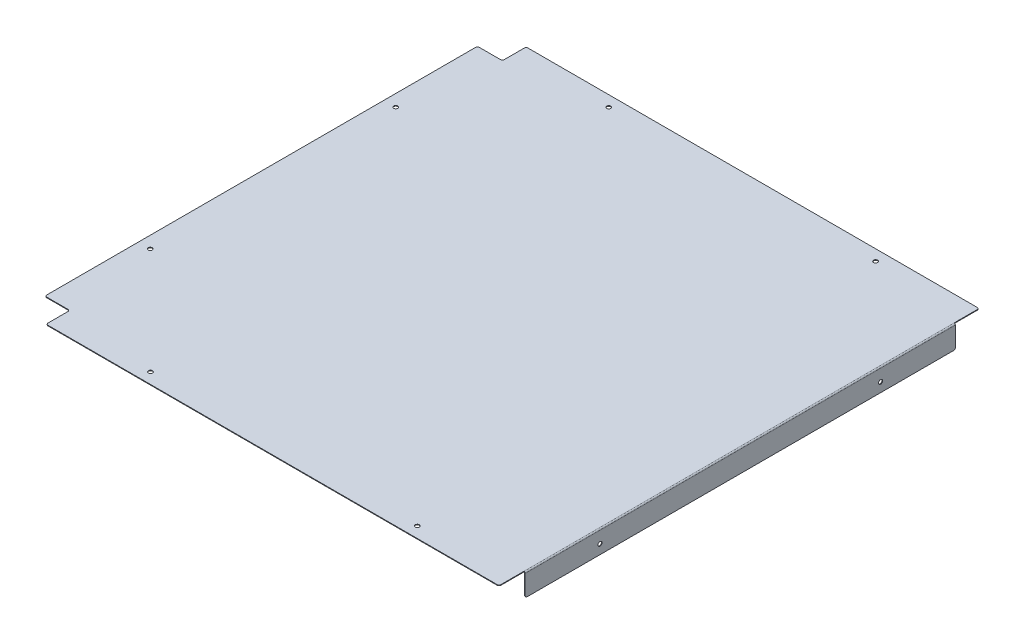
ISO-10303-21;
HEADER;
FILE_DESCRIPTION(('STEP AP214'),'2;1');
FILE_NAME('part.step','',(''),(''),'','','');
FILE_SCHEMA(('AUTOMOTIVE_DESIGN { 1 0 10303 214 1 1 1 1 }'));
ENDSEC;
DATA;
#1=APPLICATION_CONTEXT('core data for automotive mechanical design processes');
#2=APPLICATION_PROTOCOL_DEFINITION('international standard','automotive_design',2000,#1);
#3=PRODUCT_CONTEXT('',#1,'mechanical');
#4=PRODUCT('Part','Part','',(#3));
#5=PRODUCT_RELATED_PRODUCT_CATEGORY('part','',(#4));
#6=PRODUCT_DEFINITION_FORMATION('','',#4);
#7=PRODUCT_DEFINITION_CONTEXT('part definition',#1,'design');
#8=PRODUCT_DEFINITION('design','',#6,#7);
#9=PRODUCT_DEFINITION_SHAPE('','',#8);
#10=(LENGTH_UNIT() NAMED_UNIT(*) SI_UNIT(.MILLI.,.METRE.));
#11=(NAMED_UNIT(*) PLANE_ANGLE_UNIT() SI_UNIT($,.RADIAN.));
#12=(NAMED_UNIT(*) SI_UNIT($,.STERADIAN.) SOLID_ANGLE_UNIT());
#13=UNCERTAINTY_MEASURE_WITH_UNIT(LENGTH_MEASURE(1.E-05),#10,'distance_accuracy_value','');
#14=(GEOMETRIC_REPRESENTATION_CONTEXT(3) GLOBAL_UNCERTAINTY_ASSIGNED_CONTEXT((#13)) GLOBAL_UNIT_ASSIGNED_CONTEXT((#10,
#11,#12)) REPRESENTATION_CONTEXT('',''));
#15=CARTESIAN_POINT('',(0.,0.,0.));
#16=DIRECTION('',(0.,0.,1.));
#17=DIRECTION('',(1.,0.,0.));
#18=AXIS2_PLACEMENT_3D('',#15,#16,#17);
#19=CARTESIAN_POINT('',(362.5,0.,-403.582250064176));
#20=DIRECTION('',(-1.,0.,0.));
#21=DIRECTION('',(0.,0.,1.));
#22=AXIS2_PLACEMENT_3D('',#19,#20,#21);
#23=PLANE('',#22);
#24=DIRECTION('',(0.,0.,1.));
#25=VECTOR('',#24,1.);
#26=CARTESIAN_POINT('',(362.5,0.,0.));
#27=LINE('',#26,#25);
#28=CARTESIAN_POINT('',(362.5,0.,-382.));
#29=VERTEX_POINT('',#28);
#30=CARTESIAN_POINT('',(362.5,0.,-345.));
#31=VERTEX_POINT('',#30);
#32=EDGE_CURVE('E413',#29,#31,#27,.T.);
#33=ORIENTED_EDGE('',*,*,#32,.F.);
#34=DIRECTION('',(0.,-1.,0.));
#35=VECTOR('',#34,1.);
#36=CARTESIAN_POINT('',(362.5,0.99999999999989,-382.));
#37=LINE('',#36,#35);
#38=CARTESIAN_POINT('',(362.5,0.99999999999989,-382.));
#39=VERTEX_POINT('',#38);
#40=EDGE_CURVE('E441',#29,#39,#37,.F.);
#41=ORIENTED_EDGE('',*,*,#40,.T.);
#42=DIRECTION('',(0.,0.,1.));
#43=VECTOR('',#42,1.);
#44=CARTESIAN_POINT('',(362.5,0.99999999999989,-403.582250064176));
#45=LINE('',#44,#43);
#46=CARTESIAN_POINT('',(362.5,1.00000000000011,-345.));
#47=VERTEX_POINT('',#46);
#48=EDGE_CURVE('E308',#39,#47,#45,.T.);
#49=ORIENTED_EDGE('',*,*,#48,.T.);
#50=DIRECTION('',(0.,1.,0.));
#51=VECTOR('',#50,1.);
#52=CARTESIAN_POINT('',(362.5,0.,-345.));
#53=LINE('',#52,#51);
#54=EDGE_CURVE('E301',#31,#47,#53,.T.);
#55=ORIENTED_EDGE('',*,*,#54,.F.);
#56=EDGE_LOOP('',(#33,#41,#49,#55));
#57=FACE_BOUND('',#56,.T.);
#58=ADVANCED_FACE('F64',(#57),#23,.F.);
#59=CARTESIAN_POINT('',(0.,0.99999999999989,-385.));
#60=DIRECTION('',(0.,0.,1.));
#61=DIRECTION('',(1.,0.,0.));
#62=AXIS2_PLACEMENT_3D('',#59,#60,#61);
#63=PLANE('',#62);
#64=DIRECTION('',(1.,0.,0.));
#65=VECTOR('',#64,1.);
#66=CARTESIAN_POINT('',(0.,0.99999999999989,-385.));
#67=LINE('',#66,#65);
#68=CARTESIAN_POINT('',(-361.,0.99999999999989,-385.));
#69=VERTEX_POINT('',#68);
#70=CARTESIAN_POINT('',(359.5,0.99999999999989,-385.));
#71=VERTEX_POINT('',#70);
#72=EDGE_CURVE('E344',#69,#71,#67,.T.);
#73=ORIENTED_EDGE('',*,*,#72,.T.);
#74=DIRECTION('',(0.,1.,0.));
#75=VECTOR('',#74,1.);
#76=CARTESIAN_POINT('',(359.5,0.,-385.));
#77=LINE('',#76,#75);
#78=CARTESIAN_POINT('',(359.5,0.,-385.));
#79=VERTEX_POINT('',#78);
#80=EDGE_CURVE('E467',#71,#79,#77,.F.);
#81=ORIENTED_EDGE('',*,*,#80,.T.);
#82=DIRECTION('',(1.,0.,0.));
#83=VECTOR('',#82,1.);
#84=CARTESIAN_POINT('',(0.,0.,-385.));
#85=LINE('',#84,#83);
#86=CARTESIAN_POINT('',(-361.,0.,-385.));
#87=VERTEX_POINT('',#86);
#88=EDGE_CURVE('E406',#87,#79,#85,.T.);
#89=ORIENTED_EDGE('',*,*,#88,.F.);
#90=DIRECTION('',(0.,1.,0.));
#91=VECTOR('',#90,1.);
#92=CARTESIAN_POINT('',(-361.,0.99999999999989,-385.));
#93=LINE('',#92,#91);
#94=EDGE_CURVE('E463',#87,#69,#93,.T.);
#95=ORIENTED_EDGE('',*,*,#94,.T.);
#96=EDGE_LOOP('',(#73,#81,#89,#95));
#97=FACE_BOUND('',#96,.T.);
#98=ADVANCED_FACE('F586',(#97),#63,.F.);
#99=CARTESIAN_POINT('',(-364.,0.99999999999989,5.3008102957558E-13));
#100=DIRECTION('',(-1.,0.,0.));
#101=DIRECTION('',(0.,0.,1.));
#102=AXIS2_PLACEMENT_3D('',#99,#100,#101);
#103=PLANE('',#102);
#104=DIRECTION('',(0.,0.,1.));
#105=VECTOR('',#104,1.);
#106=CARTESIAN_POINT('',(-364.,0.99999999999989,5.3008102957558E-13));
#107=LINE('',#106,#105);
#108=CARTESIAN_POINT('',(-364.,0.99999999999989,-382.));
#109=VERTEX_POINT('',#108);
#110=CARTESIAN_POINT('',(-364.,0.99999999999989,-349.881188118812));
#111=VERTEX_POINT('',#110);
#112=EDGE_CURVE('E348',#109,#111,#107,.T.);
#113=ORIENTED_EDGE('',*,*,#112,.F.);
#114=DIRECTION('',(0.,-1.,0.));
#115=VECTOR('',#114,1.);
#116=CARTESIAN_POINT('',(-364.,0.99999999999989,-382.));
#117=LINE('',#116,#115);
#118=CARTESIAN_POINT('',(-364.,0.,-382.));
#119=VERTEX_POINT('',#118);
#120=EDGE_CURVE('E88',#109,#119,#117,.T.);
#121=ORIENTED_EDGE('',*,*,#120,.T.);
#122=DIRECTION('',(0.,0.,1.));
#123=VECTOR('',#122,1.);
#124=CARTESIAN_POINT('',(-364.,0.,0.));
#125=LINE('',#124,#123);
#126=CARTESIAN_POINT('',(-364.,0.,-349.881188118812));
#127=VERTEX_POINT('',#126);
#128=EDGE_CURVE('E403',#119,#127,#125,.T.);
#129=ORIENTED_EDGE('',*,*,#128,.T.);
#130=DIRECTION('',(0.,-1.,0.));
#131=VECTOR('',#130,1.);
#132=CARTESIAN_POINT('',(-364.,0.99999999999989,-349.881188118812));
#133=LINE('',#132,#131);
#134=EDGE_CURVE('E487',#127,#111,#133,.F.);
#135=ORIENTED_EDGE('',*,*,#134,.T.);
#136=EDGE_LOOP('',(#113,#121,#129,#135));
#137=FACE_BOUND('',#136,.T.);
#138=ADVANCED_FACE('F578',(#137),#103,.T.);
#139=CARTESIAN_POINT('',(0.,0.99999999999989,-346.881188118812));
#140=DIRECTION('',(0.,0.,1.));
#141=DIRECTION('',(1.,0.,0.));
#142=AXIS2_PLACEMENT_3D('',#139,#140,#141);
#143=PLANE('',#142);
#144=DIRECTION('',(1.,0.,0.));
#145=VECTOR('',#144,1.);
#146=CARTESIAN_POINT('',(0.,0.99999999999989,-346.881188118812));
#147=LINE('',#146,#145);
#148=CARTESIAN_POINT('',(-401.,0.99999999999989,-346.881188118812));
#149=VERTEX_POINT('',#148);
#150=CARTESIAN_POINT('',(-367.,0.99999999999989,-346.881188118812));
#151=VERTEX_POINT('',#150);
#152=EDGE_CURVE('E352',#149,#151,#147,.T.);
#153=ORIENTED_EDGE('',*,*,#152,.T.);
#154=DIRECTION('',(0.,1.,0.));
#155=VECTOR('',#154,1.);
#156=CARTESIAN_POINT('',(-367.,0.,-346.881188118812));
#157=LINE('',#156,#155);
#158=CARTESIAN_POINT('',(-367.,0.,-346.881188118812));
#159=VERTEX_POINT('',#158);
#160=EDGE_CURVE('E497',#151,#159,#157,.F.);
#161=ORIENTED_EDGE('',*,*,#160,.T.);
#162=DIRECTION('',(1.,0.,0.));
#163=VECTOR('',#162,1.);
#164=CARTESIAN_POINT('',(0.,0.,-346.881188118812));
#165=LINE('',#164,#163);
#166=CARTESIAN_POINT('',(-401.,0.,-346.881188118812));
#167=VERTEX_POINT('',#166);
#168=EDGE_CURVE('E400',#167,#159,#165,.T.);
#169=ORIENTED_EDGE('',*,*,#168,.F.);
#170=DIRECTION('',(0.,-1.,0.));
#171=VECTOR('',#170,1.);
#172=CARTESIAN_POINT('',(-401.,0.99999999999989,-346.881188118812));
#173=LINE('',#172,#171);
#174=EDGE_CURVE('E493',#167,#149,#173,.F.);
#175=ORIENTED_EDGE('',*,*,#174,.T.);
#176=EDGE_LOOP('',(#153,#161,#169,#175));
#177=FACE_BOUND('',#176,.T.);
#178=ADVANCED_FACE('F572',(#177),#143,.F.);
#179=CARTESIAN_POINT('',(-404.,0.99999999999989,0.));
#180=DIRECTION('',(1.,0.,0.));
#181=DIRECTION('',(0.,0.,-1.));
#182=AXIS2_PLACEMENT_3D('',#179,#180,#181);
#183=PLANE('',#182);
#184=DIRECTION('',(0.,0.,-1.));
#185=VECTOR('',#184,1.);
#186=CARTESIAN_POINT('',(-404.,0.99999999999989,0.));
#187=LINE('',#186,#185);
#188=CARTESIAN_POINT('',(-404.,0.99999999999989,343.881188118812));
#189=VERTEX_POINT('',#188);
#190=CARTESIAN_POINT('',(-404.,0.99999999999989,-343.881188118812));
#191=VERTEX_POINT('',#190);
#192=EDGE_CURVE('E356',#189,#191,#187,.T.);
#193=ORIENTED_EDGE('',*,*,#192,.T.);
#194=DIRECTION('',(0.,-1.,0.));
#195=VECTOR('',#194,1.);
#196=CARTESIAN_POINT('',(-404.,0.99999999999989,-343.881188118812));
#197=LINE('',#196,#195);
#198=CARTESIAN_POINT('',(-404.,0.,-343.881188118812));
#199=VERTEX_POINT('',#198);
#200=EDGE_CURVE('E504',#191,#199,#197,.T.);
#201=ORIENTED_EDGE('',*,*,#200,.T.);
#202=DIRECTION('',(0.,0.,1.));
#203=VECTOR('',#202,1.);
#204=CARTESIAN_POINT('',(-404.,0.,0.));
#205=LINE('',#204,#203);
#206=CARTESIAN_POINT('',(-404.,0.,343.881188118812));
#207=VERTEX_POINT('',#206);
#208=EDGE_CURVE('E396',#207,#199,#205,.F.);
#209=ORIENTED_EDGE('',*,*,#208,.F.);
#210=DIRECTION('',(0.,1.,0.));
#211=VECTOR('',#210,1.);
#212=CARTESIAN_POINT('',(-404.,0.99999999999989,343.881188118812));
#213=LINE('',#212,#211);
#214=EDGE_CURVE('E500',#207,#189,#213,.T.);
#215=ORIENTED_EDGE('',*,*,#214,.T.);
#216=EDGE_LOOP('',(#193,#201,#209,#215));
#217=FACE_BOUND('',#216,.T.);
#218=ADVANCED_FACE('F564',(#217),#183,.F.);
#219=CARTESIAN_POINT('',(0.,0.99999999999989,346.881188118812));
#220=DIRECTION('',(0.,0.,1.));
#221=DIRECTION('',(1.,0.,0.));
#222=AXIS2_PLACEMENT_3D('',#219,#220,#221);
#223=PLANE('',#222);
#224=DIRECTION('',(1.,0.,0.));
#225=VECTOR('',#224,1.);
#226=CARTESIAN_POINT('',(0.,0.99999999999989,346.881188118812));
#227=LINE('',#226,#225);
#228=CARTESIAN_POINT('',(-401.,0.99999999999989,346.881188118812));
#229=VERTEX_POINT('',#228);
#230=CARTESIAN_POINT('',(-367.,0.99999999999989,346.881188118812));
#231=VERTEX_POINT('',#230);
#232=EDGE_CURVE('E360',#229,#231,#227,.T.);
#233=ORIENTED_EDGE('',*,*,#232,.F.);
#234=DIRECTION('',(0.,-1.,0.));
#235=VECTOR('',#234,1.);
#236=CARTESIAN_POINT('',(-401.,0.99999999999989,346.881188118812));
#237=LINE('',#236,#235);
#238=CARTESIAN_POINT('',(-401.,0.,346.881188118812));
#239=VERTEX_POINT('',#238);
#240=EDGE_CURVE('E511',#229,#239,#237,.T.);
#241=ORIENTED_EDGE('',*,*,#240,.T.);
#242=DIRECTION('',(1.,0.,0.));
#243=VECTOR('',#242,1.);
#244=CARTESIAN_POINT('',(0.,0.,346.881188118812));
#245=LINE('',#244,#243);
#246=CARTESIAN_POINT('',(-367.,0.,346.881188118812));
#247=VERTEX_POINT('',#246);
#248=EDGE_CURVE('E317',#239,#247,#245,.T.);
#249=ORIENTED_EDGE('',*,*,#248,.T.);
#250=DIRECTION('',(0.,-1.,0.));
#251=VECTOR('',#250,1.);
#252=CARTESIAN_POINT('',(-367.,0.99999999999989,346.881188118812));
#253=LINE('',#252,#251);
#254=EDGE_CURVE('E507',#247,#231,#253,.F.);
#255=ORIENTED_EDGE('',*,*,#254,.T.);
#256=EDGE_LOOP('',(#233,#241,#249,#255));
#257=FACE_BOUND('',#256,.T.);
#258=ADVANCED_FACE('F556',(#257),#223,.T.);
#259=CARTESIAN_POINT('',(-364.,0.99999999999989,-5.3008102957558E-13));
#260=DIRECTION('',(1.,0.,0.));
#261=DIRECTION('',(0.,0.,-1.));
#262=AXIS2_PLACEMENT_3D('',#259,#260,#261);
#263=PLANE('',#262);
#264=DIRECTION('',(0.,0.,-1.));
#265=VECTOR('',#264,1.);
#266=CARTESIAN_POINT('',(-364.,0.99999999999989,-5.3008102957558E-13));
#267=LINE('',#266,#265);
#268=CARTESIAN_POINT('',(-364.,0.99999999999989,382.));
#269=VERTEX_POINT('',#268);
#270=CARTESIAN_POINT('',(-364.,0.99999999999989,349.881188118812));
#271=VERTEX_POINT('',#270);
#272=EDGE_CURVE('E336',#269,#271,#267,.T.);
#273=ORIENTED_EDGE('',*,*,#272,.T.);
#274=DIRECTION('',(0.,1.,0.));
#275=VECTOR('',#274,1.);
#276=CARTESIAN_POINT('',(-364.,0.,349.881188118812));
#277=LINE('',#276,#275);
#278=CARTESIAN_POINT('',(-364.,0.,349.881188118812));
#279=VERTEX_POINT('',#278);
#280=EDGE_CURVE('E518',#271,#279,#277,.F.);
#281=ORIENTED_EDGE('',*,*,#280,.T.);
#282=DIRECTION('',(0.,0.,1.));
#283=VECTOR('',#282,1.);
#284=CARTESIAN_POINT('',(-364.,0.,0.));
#285=LINE('',#284,#283);
#286=CARTESIAN_POINT('',(-364.,0.,382.));
#287=VERTEX_POINT('',#286);
#288=EDGE_CURVE('E388',#287,#279,#285,.F.);
#289=ORIENTED_EDGE('',*,*,#288,.F.);
#290=DIRECTION('',(0.,1.,0.));
#291=VECTOR('',#290,1.);
#292=CARTESIAN_POINT('',(-364.,0.99999999999989,382.));
#293=LINE('',#292,#291);
#294=EDGE_CURVE('E514',#287,#269,#293,.T.);
#295=ORIENTED_EDGE('',*,*,#294,.T.);
#296=EDGE_LOOP('',(#273,#281,#289,#295));
#297=FACE_BOUND('',#296,.T.);
#298=ADVANCED_FACE('F547',(#297),#263,.F.);
#299=CARTESIAN_POINT('',(-214.,1.00000000000011,367.5));
#300=DIRECTION('',(0.,1.,0.));
#301=DIRECTION('',(0.,0.,1.));
#302=AXIS2_PLACEMENT_3D('',#299,#300,#301);
#303=CYLINDRICAL_SURFACE('',#302,3.3);
#304=CARTESIAN_POINT('',(-214.,1.00000000000011,367.5));
#305=DIRECTION('',(0.,1.,0.));
#306=DIRECTION('',(0.,0.,1.));
#307=AXIS2_PLACEMENT_3D('',#304,#305,#306);
#308=CIRCLE('',#307,3.3);
#309=CARTESIAN_POINT('',(-214.,1.00000000000011,370.8));
#310=VERTEX_POINT('',#309);
#311=EDGE_CURVE('E312',#310,#310,#308,.T.);
#312=ORIENTED_EDGE('',*,*,#311,.T.);
#313=EDGE_LOOP('',(#312));
#314=FACE_BOUND('',#313,.T.);
#315=CARTESIAN_POINT('',(-214.,0.,367.5));
#316=DIRECTION('',(0.,1.,0.));
#317=DIRECTION('',(0.,0.,1.));
#318=AXIS2_PLACEMENT_3D('',#315,#316,#317);
#319=CIRCLE('',#318,3.3);
#320=CARTESIAN_POINT('',(-214.,0.,370.8));
#321=VERTEX_POINT('',#320);
#322=EDGE_CURVE('E311',#321,#321,#319,.T.);
#323=ORIENTED_EDGE('',*,*,#322,.F.);
#324=EDGE_LOOP('',(#323));
#325=FACE_BOUND('',#324,.T.);
#326=ADVANCED_FACE('F674',(#314,#325),#303,.F.);
#327=CARTESIAN_POINT('',(-385.,1.00000000000011,196.881188118812));
#328=DIRECTION('',(0.,1.,0.));
#329=DIRECTION('',(0.,0.,1.));
#330=AXIS2_PLACEMENT_3D('',#327,#328,#329);
#331=CYLINDRICAL_SURFACE('',#330,3.29999999999997);
#332=CARTESIAN_POINT('',(-385.,1.00000000000011,196.881188118812));
#333=DIRECTION('',(0.,1.,0.));
#334=DIRECTION('',(0.,0.,1.));
#335=AXIS2_PLACEMENT_3D('',#332,#333,#334);
#336=CIRCLE('',#335,3.29999999999997);
#337=CARTESIAN_POINT('',(-385.,1.00000000000011,200.181188118812));
#338=VERTEX_POINT('',#337);
#339=EDGE_CURVE('E316',#338,#338,#336,.T.);
#340=ORIENTED_EDGE('',*,*,#339,.T.);
#341=EDGE_LOOP('',(#340));
#342=FACE_BOUND('',#341,.T.);
#343=CARTESIAN_POINT('',(-385.,0.,196.881188118812));
#344=DIRECTION('',(0.,1.,0.));
#345=DIRECTION('',(0.,0.,1.));
#346=AXIS2_PLACEMENT_3D('',#343,#344,#345);
#347=CIRCLE('',#346,3.29999999999997);
#348=CARTESIAN_POINT('',(-385.,0.,200.181188118812));
#349=VERTEX_POINT('',#348);
#350=EDGE_CURVE('E368',#349,#349,#347,.T.);
#351=ORIENTED_EDGE('',*,*,#350,.F.);
#352=EDGE_LOOP('',(#351));
#353=FACE_BOUND('',#352,.T.);
#354=ADVANCED_FACE('F677',(#342,#353),#331,.F.);
#355=CARTESIAN_POINT('',(-385.,1.00000000000011,-196.881188118812));
#356=DIRECTION('',(0.,1.,0.));
#357=DIRECTION('',(0.,0.,1.));
#358=AXIS2_PLACEMENT_3D('',#355,#356,#357);
#359=CYLINDRICAL_SURFACE('',#358,3.29999999999997);
#360=CARTESIAN_POINT('',(-385.,1.00000000000011,-196.881188118812));
#361=DIRECTION('',(0.,1.,0.));
#362=DIRECTION('',(0.,0.,1.));
#363=AXIS2_PLACEMENT_3D('',#360,#361,#362);
#364=CIRCLE('',#363,3.29999999999997);
#365=CARTESIAN_POINT('',(-385.,1.00000000000011,-193.581188118812));
#366=VERTEX_POINT('',#365);
#367=EDGE_CURVE('E321',#366,#366,#364,.T.);
#368=ORIENTED_EDGE('',*,*,#367,.T.);
#369=EDGE_LOOP('',(#368));
#370=FACE_BOUND('',#369,.T.);
#371=CARTESIAN_POINT('',(-385.,0.,-196.881188118812));
#372=DIRECTION('',(0.,1.,0.));
#373=DIRECTION('',(0.,0.,1.));
#374=AXIS2_PLACEMENT_3D('',#371,#372,#373);
#375=CIRCLE('',#374,3.29999999999997);
#376=CARTESIAN_POINT('',(-385.,0.,-193.581188118812));
#377=VERTEX_POINT('',#376);
#378=EDGE_CURVE('E372',#377,#377,#375,.T.);
#379=ORIENTED_EDGE('',*,*,#378,.F.);
#380=EDGE_LOOP('',(#379));
#381=FACE_BOUND('',#380,.T.);
#382=ADVANCED_FACE('F681',(#370,#381),#359,.F.);
#383=CARTESIAN_POINT('',(-214.,1.00000000000011,-367.5));
#384=DIRECTION('',(0.,1.,0.));
#385=DIRECTION('',(0.,0.,1.));
#386=AXIS2_PLACEMENT_3D('',#383,#384,#385);
#387=CYLINDRICAL_SURFACE('',#386,3.3);
#388=CARTESIAN_POINT('',(-214.,1.00000000000011,-367.5));
#389=DIRECTION('',(0.,1.,0.));
#390=DIRECTION('',(0.,0.,1.));
#391=AXIS2_PLACEMENT_3D('',#388,#389,#390);
#392=CIRCLE('',#391,3.3);
#393=CARTESIAN_POINT('',(-214.,1.00000000000011,-364.2));
#394=VERTEX_POINT('',#393);
#395=EDGE_CURVE('E324',#394,#394,#392,.T.);
#396=ORIENTED_EDGE('',*,*,#395,.T.);
#397=EDGE_LOOP('',(#396));
#398=FACE_BOUND('',#397,.T.);
#399=CARTESIAN_POINT('',(-214.,0.,-367.5));
#400=DIRECTION('',(0.,1.,0.));
#401=DIRECTION('',(0.,0.,1.));
#402=AXIS2_PLACEMENT_3D('',#399,#400,#401);
#403=CIRCLE('',#402,3.3);
#404=CARTESIAN_POINT('',(-214.,0.,-364.2));
#405=VERTEX_POINT('',#404);
#406=EDGE_CURVE('E376',#405,#405,#403,.T.);
#407=ORIENTED_EDGE('',*,*,#406,.F.);
#408=EDGE_LOOP('',(#407));
#409=FACE_BOUND('',#408,.T.);
#410=ADVANCED_FACE('F685',(#398,#409),#387,.F.);
#411=CARTESIAN_POINT('',(214.,1.00000000000011,-367.5));
#412=DIRECTION('',(0.,1.,0.));
#413=DIRECTION('',(0.,0.,1.));
#414=AXIS2_PLACEMENT_3D('',#411,#412,#413);
#415=CYLINDRICAL_SURFACE('',#414,3.3);
#416=CARTESIAN_POINT('',(214.,1.00000000000011,-367.5));
#417=DIRECTION('',(0.,1.,0.));
#418=DIRECTION('',(0.,0.,1.));
#419=AXIS2_PLACEMENT_3D('',#416,#417,#418);
#420=CIRCLE('',#419,3.3);
#421=CARTESIAN_POINT('',(214.,1.00000000000011,-364.2));
#422=VERTEX_POINT('',#421);
#423=EDGE_CURVE('E328',#422,#422,#420,.T.);
#424=ORIENTED_EDGE('',*,*,#423,.T.);
#425=EDGE_LOOP('',(#424));
#426=FACE_BOUND('',#425,.T.);
#427=CARTESIAN_POINT('',(214.,0.,-367.5));
#428=DIRECTION('',(0.,1.,0.));
#429=DIRECTION('',(0.,0.,1.));
#430=AXIS2_PLACEMENT_3D('',#427,#428,#429);
#431=CIRCLE('',#430,3.3);
#432=CARTESIAN_POINT('',(214.,0.,-364.2));
#433=VERTEX_POINT('',#432);
#434=EDGE_CURVE('E380',#433,#433,#431,.T.);
#435=ORIENTED_EDGE('',*,*,#434,.F.);
#436=EDGE_LOOP('',(#435));
#437=FACE_BOUND('',#436,.T.);
#438=ADVANCED_FACE('F689',(#426,#437),#415,.F.);
#439=CARTESIAN_POINT('',(214.,1.00000000000011,367.5));
#440=DIRECTION('',(0.,1.,0.));
#441=DIRECTION('',(0.,0.,1.));
#442=AXIS2_PLACEMENT_3D('',#439,#440,#441);
#443=CYLINDRICAL_SURFACE('',#442,3.3);
#444=CARTESIAN_POINT('',(214.,1.00000000000011,367.5));
#445=DIRECTION('',(0.,1.,0.));
#446=DIRECTION('',(0.,0.,1.));
#447=AXIS2_PLACEMENT_3D('',#444,#445,#446);
#448=CIRCLE('',#447,3.3);
#449=CARTESIAN_POINT('',(214.,1.00000000000011,370.8));
#450=VERTEX_POINT('',#449);
#451=EDGE_CURVE('E332',#450,#450,#448,.T.);
#452=ORIENTED_EDGE('',*,*,#451,.T.);
#453=EDGE_LOOP('',(#452));
#454=FACE_BOUND('',#453,.T.);
#455=CARTESIAN_POINT('',(214.,0.,367.5));
#456=DIRECTION('',(0.,1.,0.));
#457=DIRECTION('',(0.,0.,1.));
#458=AXIS2_PLACEMENT_3D('',#455,#456,#457);
#459=CIRCLE('',#458,3.3);
#460=CARTESIAN_POINT('',(214.,0.,370.8));
#461=VERTEX_POINT('',#460);
#462=EDGE_CURVE('E384',#461,#461,#459,.T.);
#463=ORIENTED_EDGE('',*,*,#462,.F.);
#464=EDGE_LOOP('',(#463));
#465=FACE_BOUND('',#464,.T.);
#466=ADVANCED_FACE('F693',(#454,#465),#443,.F.);
#467=CARTESIAN_POINT('',(0.,0.99999999999989,385.));
#468=DIRECTION('',(0.,0.,1.));
#469=DIRECTION('',(1.,0.,0.));
#470=AXIS2_PLACEMENT_3D('',#467,#468,#469);
#471=PLANE('',#470);
#472=DIRECTION('',(1.,0.,0.));
#473=VECTOR('',#472,1.);
#474=CARTESIAN_POINT('',(0.,0.99999999999989,385.));
#475=LINE('',#474,#473);
#476=CARTESIAN_POINT('',(-361.,0.99999999999989,385.));
#477=VERTEX_POINT('',#476);
#478=CARTESIAN_POINT('',(359.5,0.99999999999989,385.));
#479=VERTEX_POINT('',#478);
#480=EDGE_CURVE('E340',#477,#479,#475,.T.);
#481=ORIENTED_EDGE('',*,*,#480,.F.);
#482=DIRECTION('',(0.,-1.,0.));
#483=VECTOR('',#482,1.);
#484=CARTESIAN_POINT('',(-361.,0.99999999999989,385.));
#485=LINE('',#484,#483);
#486=CARTESIAN_POINT('',(-361.,0.,385.));
#487=VERTEX_POINT('',#486);
#488=EDGE_CURVE('E524',#477,#487,#485,.T.);
#489=ORIENTED_EDGE('',*,*,#488,.T.);
#490=DIRECTION('',(1.,0.,0.));
#491=VECTOR('',#490,1.);
#492=CARTESIAN_POINT('',(0.,0.,385.));
#493=LINE('',#492,#491);
#494=CARTESIAN_POINT('',(359.5,0.,385.));
#495=VERTEX_POINT('',#494);
#496=EDGE_CURVE('E392',#487,#495,#493,.T.);
#497=ORIENTED_EDGE('',*,*,#496,.T.);
#498=DIRECTION('',(0.,-1.,0.));
#499=VECTOR('',#498,1.);
#500=CARTESIAN_POINT('',(359.5,0.99999999999989,385.));
#501=LINE('',#500,#499);
#502=EDGE_CURVE('E521',#495,#479,#501,.F.);
#503=ORIENTED_EDGE('',*,*,#502,.T.);
#504=EDGE_LOOP('',(#481,#489,#497,#503));
#505=FACE_BOUND('',#504,.T.);
#506=ADVANCED_FACE('F671',(#505),#471,.T.);
#507=CARTESIAN_POINT('',(0.,0.99999999999989,0.));
#508=DIRECTION('',(0.,1.,0.));
#509=DIRECTION('',(0.,0.,1.));
#510=AXIS2_PLACEMENT_3D('',#507,#508,#509);
#511=PLANE('',#510);
#512=ORIENTED_EDGE('',*,*,#48,.F.);
#513=CARTESIAN_POINT('',(359.5,0.99999999999989,-382.));
#514=DIRECTION('',(0.,1.,0.));
#515=DIRECTION('',(0.,0.,1.));
#516=AXIS2_PLACEMENT_3D('',#513,#514,#515);
#517=CIRCLE('',#516,3.);
#518=EDGE_CURVE('E460',#39,#71,#517,.T.);
#519=ORIENTED_EDGE('',*,*,#518,.T.);
#520=ORIENTED_EDGE('',*,*,#72,.F.);
#521=CARTESIAN_POINT('',(-361.,0.99999999999989,-382.));
#522=DIRECTION('',(0.,1.,0.));
#523=DIRECTION('',(0.,0.,1.));
#524=AXIS2_PLACEMENT_3D('',#521,#522,#523);
#525=CIRCLE('',#524,3.);
#526=EDGE_CURVE('E457',#69,#109,#525,.T.);
#527=ORIENTED_EDGE('',*,*,#526,.T.);
#528=ORIENTED_EDGE('',*,*,#112,.T.);
#529=CARTESIAN_POINT('',(-367.,0.99999999999989,-349.881188118812));
#530=DIRECTION('',(0.,1.,0.));
#531=DIRECTION('',(0.,0.,1.));
#532=AXIS2_PLACEMENT_3D('',#529,#530,#531);
#533=CIRCLE('',#532,3.);
#534=EDGE_CURVE('E531',#111,#151,#533,.F.);
#535=ORIENTED_EDGE('',*,*,#534,.T.);
#536=ORIENTED_EDGE('',*,*,#152,.F.);
#537=CARTESIAN_POINT('',(-401.,0.99999999999989,-343.881188118812));
#538=DIRECTION('',(0.,1.,0.));
#539=DIRECTION('',(0.,0.,1.));
#540=AXIS2_PLACEMENT_3D('',#537,#538,#539);
#541=CIRCLE('',#540,3.);
#542=EDGE_CURVE('E454',#149,#191,#541,.T.);
#543=ORIENTED_EDGE('',*,*,#542,.T.);
#544=ORIENTED_EDGE('',*,*,#192,.F.);
#545=CARTESIAN_POINT('',(-401.,0.99999999999989,343.881188118812));
#546=DIRECTION('',(0.,1.,0.));
#547=DIRECTION('',(0.,0.,1.));
#548=AXIS2_PLACEMENT_3D('',#545,#546,#547);
#549=CIRCLE('',#548,3.);
#550=EDGE_CURVE('E451',#189,#229,#549,.T.);
#551=ORIENTED_EDGE('',*,*,#550,.T.);
#552=ORIENTED_EDGE('',*,*,#232,.T.);
#553=CARTESIAN_POINT('',(-367.,0.99999999999989,349.881188118812));
#554=DIRECTION('',(0.,1.,0.));
#555=DIRECTION('',(0.,0.,1.));
#556=AXIS2_PLACEMENT_3D('',#553,#554,#555);
#557=CIRCLE('',#556,3.);
#558=EDGE_CURVE('E74',#231,#271,#557,.F.);
#559=ORIENTED_EDGE('',*,*,#558,.T.);
#560=ORIENTED_EDGE('',*,*,#272,.F.);
#561=CARTESIAN_POINT('',(-361.,0.99999999999989,382.));
#562=DIRECTION('',(0.,1.,0.));
#563=DIRECTION('',(0.,0.,1.));
#564=AXIS2_PLACEMENT_3D('',#561,#562,#563);
#565=CIRCLE('',#564,3.);
#566=EDGE_CURVE('E448',#269,#477,#565,.T.);
#567=ORIENTED_EDGE('',*,*,#566,.T.);
#568=ORIENTED_EDGE('',*,*,#480,.T.);
#569=CARTESIAN_POINT('',(359.5,0.99999999999989,382.));
#570=DIRECTION('',(0.,1.,0.));
#571=DIRECTION('',(0.,0.,1.));
#572=AXIS2_PLACEMENT_3D('',#569,#570,#571);
#573=CIRCLE('',#572,3.);
#574=CARTESIAN_POINT('',(362.5,0.99999999999989,382.));
#575=VERTEX_POINT('',#574);
#576=EDGE_CURVE('E445',#479,#575,#573,.T.);
#577=ORIENTED_EDGE('',*,*,#576,.T.);
#578=CARTESIAN_POINT('',(362.5,0.99999999999989,345.012501953735));
#579=VERTEX_POINT('',#578);
#580=EDGE_CURVE('E305',#579,#575,#45,.T.);
#581=ORIENTED_EDGE('',*,*,#580,.F.);
#582=DIRECTION('',(0.,0.,1.));
#583=VECTOR('',#582,1.);
#584=CARTESIAN_POINT('',(362.5,1.00000000000011,345.012501953736));
#585=LINE('',#584,#583);
#586=EDGE_CURVE('E251',#579,#47,#585,.F.);
#587=ORIENTED_EDGE('',*,*,#586,.T.);
#588=EDGE_LOOP('',(#512,#519,#520,#527,#528,#535,#536,#543,#544,#551,#552,#559,#560,#567,#568,
#577,#581,#587));
#589=FACE_BOUND('',#588,.T.);
#590=ORIENTED_EDGE('',*,*,#311,.F.);
#591=EDGE_LOOP('',(#590));
#592=FACE_BOUND('',#591,.T.);
#593=ORIENTED_EDGE('',*,*,#339,.F.);
#594=EDGE_LOOP('',(#593));
#595=FACE_BOUND('',#594,.T.);
#596=ORIENTED_EDGE('',*,*,#367,.F.);
#597=EDGE_LOOP('',(#596));
#598=FACE_BOUND('',#597,.T.);
#599=ORIENTED_EDGE('',*,*,#395,.F.);
#600=EDGE_LOOP('',(#599));
#601=FACE_BOUND('',#600,.T.);
#602=ORIENTED_EDGE('',*,*,#423,.F.);
#603=EDGE_LOOP('',(#602));
#604=FACE_BOUND('',#603,.T.);
#605=ORIENTED_EDGE('',*,*,#451,.F.);
#606=EDGE_LOOP('',(#605));
#607=FACE_BOUND('',#606,.T.);
#608=ADVANCED_FACE('F540',(#589,#592,#595,#598,#601,#604,#607),#511,.T.);
#609=CARTESIAN_POINT('',(0.,0.,0.));
#610=DIRECTION('',(0.,1.,0.));
#611=DIRECTION('',(0.,0.,1.));
#612=AXIS2_PLACEMENT_3D('',#609,#610,#611);
#613=PLANE('',#612);
#614=ORIENTED_EDGE('',*,*,#322,.T.);
#615=EDGE_LOOP('',(#614));
#616=FACE_BOUND('',#615,.T.);
#617=ORIENTED_EDGE('',*,*,#350,.T.);
#618=EDGE_LOOP('',(#617));
#619=FACE_BOUND('',#618,.T.);
#620=ORIENTED_EDGE('',*,*,#378,.T.);
#621=EDGE_LOOP('',(#620));
#622=FACE_BOUND('',#621,.T.);
#623=ORIENTED_EDGE('',*,*,#406,.T.);
#624=EDGE_LOOP('',(#623));
#625=FACE_BOUND('',#624,.T.);
#626=ORIENTED_EDGE('',*,*,#434,.T.);
#627=EDGE_LOOP('',(#626));
#628=FACE_BOUND('',#627,.T.);
#629=ORIENTED_EDGE('',*,*,#462,.T.);
#630=EDGE_LOOP('',(#629));
#631=FACE_BOUND('',#630,.T.);
#632=ORIENTED_EDGE('',*,*,#88,.T.);
#633=CARTESIAN_POINT('',(359.5,0.,-382.));
#634=DIRECTION('',(0.,1.,0.));
#635=DIRECTION('',(0.,0.,1.));
#636=AXIS2_PLACEMENT_3D('',#633,#634,#635);
#637=CIRCLE('',#636,3.);
#638=EDGE_CURVE('E485',#79,#29,#637,.F.);
#639=ORIENTED_EDGE('',*,*,#638,.T.);
#640=ORIENTED_EDGE('',*,*,#32,.T.);
#641=DIRECTION('',(0.,0.,1.));
#642=VECTOR('',#641,1.);
#643=CARTESIAN_POINT('',(362.5,2.22044604925031E-13,345.012501953736));
#644=LINE('',#643,#642);
#645=CARTESIAN_POINT('',(362.5,2.22044604925031E-13,345.012501953736));
#646=VERTEX_POINT('',#645);
#647=EDGE_CURVE('E295',#646,#31,#644,.F.);
#648=ORIENTED_EDGE('',*,*,#647,.F.);
#649=CARTESIAN_POINT('',(362.5,0.,382.));
#650=VERTEX_POINT('',#649);
#651=EDGE_CURVE('E364',#646,#650,#27,.T.);
#652=ORIENTED_EDGE('',*,*,#651,.T.);
#653=CARTESIAN_POINT('',(359.5,0.,382.));
#654=DIRECTION('',(0.,1.,0.));
#655=DIRECTION('',(0.,0.,1.));
#656=AXIS2_PLACEMENT_3D('',#653,#654,#655);
#657=CIRCLE('',#656,3.);
#658=EDGE_CURVE('E470',#650,#495,#657,.F.);
#659=ORIENTED_EDGE('',*,*,#658,.T.);
#660=ORIENTED_EDGE('',*,*,#496,.F.);
#661=CARTESIAN_POINT('',(-361.,0.,382.));
#662=DIRECTION('',(0.,1.,0.));
#663=DIRECTION('',(0.,0.,1.));
#664=AXIS2_PLACEMENT_3D('',#661,#662,#663);
#665=CIRCLE('',#664,3.);
#666=EDGE_CURVE('E473',#487,#287,#665,.F.);
#667=ORIENTED_EDGE('',*,*,#666,.T.);
#668=ORIENTED_EDGE('',*,*,#288,.T.);
#669=CARTESIAN_POINT('',(-367.,0.,349.881188118812));
#670=DIRECTION('',(0.,1.,0.));
#671=DIRECTION('',(0.,0.,1.));
#672=AXIS2_PLACEMENT_3D('',#669,#670,#671);
#673=CIRCLE('',#672,3.);
#674=EDGE_CURVE('E13',#279,#247,#673,.T.);
#675=ORIENTED_EDGE('',*,*,#674,.T.);
#676=ORIENTED_EDGE('',*,*,#248,.F.);
#677=CARTESIAN_POINT('',(-401.,0.,343.881188118812));
#678=DIRECTION('',(0.,1.,0.));
#679=DIRECTION('',(0.,0.,1.));
#680=AXIS2_PLACEMENT_3D('',#677,#678,#679);
#681=CIRCLE('',#680,3.);
#682=EDGE_CURVE('E476',#239,#207,#681,.F.);
#683=ORIENTED_EDGE('',*,*,#682,.T.);
#684=ORIENTED_EDGE('',*,*,#208,.T.);
#685=CARTESIAN_POINT('',(-401.,0.,-343.881188118812));
#686=DIRECTION('',(0.,1.,0.));
#687=DIRECTION('',(0.,0.,1.));
#688=AXIS2_PLACEMENT_3D('',#685,#686,#687);
#689=CIRCLE('',#688,3.);
#690=EDGE_CURVE('E479',#199,#167,#689,.F.);
#691=ORIENTED_EDGE('',*,*,#690,.T.);
#692=ORIENTED_EDGE('',*,*,#168,.T.);
#693=CARTESIAN_POINT('',(-367.,0.,-349.881188118812));
#694=DIRECTION('',(0.,1.,0.));
#695=DIRECTION('',(0.,0.,1.));
#696=AXIS2_PLACEMENT_3D('',#693,#694,#695);
#697=CIRCLE('',#696,3.);
#698=EDGE_CURVE('E81',#159,#127,#697,.T.);
#699=ORIENTED_EDGE('',*,*,#698,.T.);
#700=ORIENTED_EDGE('',*,*,#128,.F.);
#701=CARTESIAN_POINT('',(-361.,0.,-382.));
#702=DIRECTION('',(0.,1.,0.));
#703=DIRECTION('',(0.,0.,1.));
#704=AXIS2_PLACEMENT_3D('',#701,#702,#703);
#705=CIRCLE('',#704,3.);
#706=EDGE_CURVE('E482',#119,#87,#705,.F.);
#707=ORIENTED_EDGE('',*,*,#706,.T.);
#708=EDGE_LOOP('',(#632,#639,#640,#648,#652,#659,#660,#667,#668,#675,#676,#683,#684,#691,#692,
#699,#700,#707));
#709=FACE_BOUND('',#708,.T.);
#710=ADVANCED_FACE('F553',(#616,#619,#622,#625,#628,#631,#709),#613,.F.);
#711=ORIENTED_EDGE('',*,*,#580,.T.);
#712=DIRECTION('',(0.,-1.,0.));
#713=VECTOR('',#712,1.);
#714=CARTESIAN_POINT('',(362.5,0.,382.));
#715=LINE('',#714,#713);
#716=EDGE_CURVE('E527',#575,#650,#715,.T.);
#717=ORIENTED_EDGE('',*,*,#716,.T.);
#718=ORIENTED_EDGE('',*,*,#651,.F.);
#719=DIRECTION('',(0.,1.,0.));
#720=VECTOR('',#719,1.);
#721=CARTESIAN_POINT('',(362.5,2.22044604925031E-13,345.012501953736));
#722=LINE('',#721,#720);
#723=EDGE_CURVE('E290',#646,#579,#722,.T.);
#724=ORIENTED_EDGE('',*,*,#723,.T.);
#725=EDGE_LOOP('',(#711,#717,#718,#724));
#726=FACE_BOUND('',#725,.T.);
#727=ADVANCED_FACE('F653',(#726),#23,.F.);
#728=CARTESIAN_POINT('',(362.5,-0.99999999999989,-345.));
#729=DIRECTION('',(0.,0.,-1.));
#730=DIRECTION('',(0.,1.,0.));
#731=AXIS2_PLACEMENT_3D('',#728,#729,#730);
#732=PLANE('',#731);
#733=DIRECTION('',(1.,0.,0.));
#734=VECTOR('',#733,1.);
#735=CARTESIAN_POINT('',(364.5,-0.99999999999989,-345.));
#736=LINE('',#735,#734);
#737=CARTESIAN_POINT('',(363.5,-0.99999999999989,-345.));
#738=VERTEX_POINT('',#737);
#739=CARTESIAN_POINT('',(364.5,-0.99999999999989,-345.));
#740=VERTEX_POINT('',#739);
#741=EDGE_CURVE('E281',#738,#740,#736,.T.);
#742=ORIENTED_EDGE('',*,*,#741,.F.);
#743=CARTESIAN_POINT('',(362.5,-0.99999999999989,-345.));
#744=DIRECTION('',(0.,0.,1.));
#745=DIRECTION('',(0.,-1.,0.));
#746=AXIS2_PLACEMENT_3D('',#743,#744,#745);
#747=CIRCLE('',#746,1.);
#748=EDGE_CURVE('E255',#31,#738,#747,.F.);
#749=ORIENTED_EDGE('',*,*,#748,.F.);
#750=ORIENTED_EDGE('',*,*,#54,.T.);
#751=CARTESIAN_POINT('',(362.5,-0.99999999999989,-345.));
#752=DIRECTION('',(0.,0.,1.));
#753=DIRECTION('',(0.,-1.,0.));
#754=AXIS2_PLACEMENT_3D('',#751,#752,#753);
#755=CIRCLE('',#754,2.);
#756=EDGE_CURVE('E288',#47,#740,#755,.F.);
#757=ORIENTED_EDGE('',*,*,#756,.T.);
#758=EDGE_LOOP('',(#742,#749,#750,#757));
#759=FACE_BOUND('',#758,.T.);
#760=ADVANCED_FACE('F635',(#759),#732,.T.);
#761=CARTESIAN_POINT('',(362.5,-0.99999999999989,345.012501953736));
#762=DIRECTION('',(0.,0.,-1.));
#763=DIRECTION('',(0.,1.,0.));
#764=AXIS2_PLACEMENT_3D('',#761,#762,#763);
#765=PLANE('',#764);
#766=CARTESIAN_POINT('',(362.5,-0.99999999999989,345.012501953736));
#767=DIRECTION('',(0.,0.,1.));
#768=DIRECTION('',(0.,-1.,0.));
#769=AXIS2_PLACEMENT_3D('',#766,#767,#768);
#770=CIRCLE('',#769,1.);
#771=CARTESIAN_POINT('',(363.5,-0.99999999999989,345.012501953736));
#772=VERTEX_POINT('',#771);
#773=EDGE_CURVE('E240',#772,#646,#770,.T.);
#774=ORIENTED_EDGE('',*,*,#773,.F.);
#775=DIRECTION('',(1.,0.,0.));
#776=VECTOR('',#775,1.);
#777=CARTESIAN_POINT('',(363.5,-0.99999999999989,345.012501953736));
#778=LINE('',#777,#776);
#779=CARTESIAN_POINT('',(364.5,-0.99999999999989,345.012501953736));
#780=VERTEX_POINT('',#779);
#781=EDGE_CURVE('E233',#772,#780,#778,.T.);
#782=ORIENTED_EDGE('',*,*,#781,.T.);
#783=CARTESIAN_POINT('',(362.5,-0.99999999999989,345.012501953736));
#784=DIRECTION('',(0.,0.,1.));
#785=DIRECTION('',(0.,-1.,0.));
#786=AXIS2_PLACEMENT_3D('',#783,#784,#785);
#787=CIRCLE('',#786,2.);
#788=EDGE_CURVE('E245',#780,#579,#787,.T.);
#789=ORIENTED_EDGE('',*,*,#788,.T.);
#790=ORIENTED_EDGE('',*,*,#723,.F.);
#791=EDGE_LOOP('',(#774,#782,#789,#790));
#792=FACE_BOUND('',#791,.T.);
#793=ADVANCED_FACE('F258',(#792),#765,.F.);
#794=CARTESIAN_POINT('',(362.5,-0.99999999999989,345.012501953736));
#795=DIRECTION('',(0.,0.,1.));
#796=DIRECTION('',(1.,0.,0.));
#797=AXIS2_PLACEMENT_3D('',#794,#795,#796);
#798=CYLINDRICAL_SURFACE('',#797,2.);
#799=ORIENTED_EDGE('',*,*,#586,.F.);
#800=ORIENTED_EDGE('',*,*,#788,.F.);
#801=DIRECTION('',(0.,0.,1.));
#802=VECTOR('',#801,1.);
#803=CARTESIAN_POINT('',(364.5,-0.99999999999989,-345.));
#804=LINE('',#803,#802);
#805=EDGE_CURVE('E248',#780,#740,#804,.F.);
#806=ORIENTED_EDGE('',*,*,#805,.T.);
#807=ORIENTED_EDGE('',*,*,#756,.F.);
#808=EDGE_LOOP('',(#799,#800,#806,#807));
#809=FACE_BOUND('',#808,.T.);
#810=ADVANCED_FACE('F246',(#809),#798,.T.);
#811=CARTESIAN_POINT('',(362.5,-0.99999999999989,345.012501953736));
#812=DIRECTION('',(0.,0.,1.));
#813=DIRECTION('',(1.,0.,0.));
#814=AXIS2_PLACEMENT_3D('',#811,#812,#813);
#815=CYLINDRICAL_SURFACE('',#814,1.);
#816=ORIENTED_EDGE('',*,*,#647,.T.);
#817=ORIENTED_EDGE('',*,*,#748,.T.);
#818=DIRECTION('',(0.,0.,1.));
#819=VECTOR('',#818,1.);
#820=CARTESIAN_POINT('',(363.5,-0.99999999999989,-345.));
#821=LINE('',#820,#819);
#822=EDGE_CURVE('E261',#738,#772,#821,.T.);
#823=ORIENTED_EDGE('',*,*,#822,.T.);
#824=ORIENTED_EDGE('',*,*,#773,.T.);
#825=EDGE_LOOP('',(#816,#817,#823,#824));
#826=FACE_BOUND('',#825,.T.);
#827=ADVANCED_FACE('F638',(#826),#815,.F.);
#828=CARTESIAN_POINT('',(364.5,0.,-345.));
#829=DIRECTION('',(0.,0.,-1.));
#830=DIRECTION('',(-1.,0.,0.));
#831=AXIS2_PLACEMENT_3D('',#828,#829,#830);
#832=PLANE('',#831);
#833=DIRECTION('',(0.,1.,0.));
#834=VECTOR('',#833,1.);
#835=CARTESIAN_POINT('',(364.5,0.,-345.));
#836=LINE('',#835,#834);
#837=CARTESIAN_POINT('',(364.5,-32.,-345.));
#838=VERTEX_POINT('',#837);
#839=EDGE_CURVE('E266',#740,#838,#836,.F.);
#840=ORIENTED_EDGE('',*,*,#839,.T.);
#841=DIRECTION('',(-1.,0.,0.));
#842=VECTOR('',#841,1.);
#843=CARTESIAN_POINT('',(364.5,-32.,-345.));
#844=LINE('',#843,#842);
#845=CARTESIAN_POINT('',(363.5,-32.,-345.));
#846=VERTEX_POINT('',#845);
#847=EDGE_CURVE('E437',#838,#846,#844,.T.);
#848=ORIENTED_EDGE('',*,*,#847,.T.);
#849=DIRECTION('',(0.,-1.,0.));
#850=VECTOR('',#849,1.);
#851=CARTESIAN_POINT('',(363.5,1.11022302462516E-12,-345.));
#852=LINE('',#851,#850);
#853=EDGE_CURVE('E268',#738,#846,#852,.T.);
#854=ORIENTED_EDGE('',*,*,#853,.F.);
#855=ORIENTED_EDGE('',*,*,#741,.T.);
#856=EDGE_LOOP('',(#840,#848,#854,#855));
#857=FACE_BOUND('',#856,.T.);
#858=ADVANCED_FACE('F631',(#857),#832,.T.);
#859=CARTESIAN_POINT('',(364.5,-34.9999999999999,345.012501953736));
#860=DIRECTION('',(0.,0.,1.));
#861=DIRECTION('',(1.,0.,0.));
#862=AXIS2_PLACEMENT_3D('',#859,#860,#861);
#863=PLANE('',#862);
#864=DIRECTION('',(0.,1.,0.));
#865=VECTOR('',#864,1.);
#866=CARTESIAN_POINT('',(363.5,1.11022302462516E-12,345.012501953736));
#867=LINE('',#866,#865);
#868=CARTESIAN_POINT('',(363.5,-32.,345.012501953736));
#869=VERTEX_POINT('',#868);
#870=EDGE_CURVE('E603',#869,#772,#867,.T.);
#871=ORIENTED_EDGE('',*,*,#870,.F.);
#872=DIRECTION('',(-1.,0.,0.));
#873=VECTOR('',#872,1.);
#874=CARTESIAN_POINT('',(364.5,-32.,345.012501953736));
#875=LINE('',#874,#873);
#876=CARTESIAN_POINT('',(364.5,-32.,345.012501953736));
#877=VERTEX_POINT('',#876);
#878=EDGE_CURVE('E235',#869,#877,#875,.F.);
#879=ORIENTED_EDGE('',*,*,#878,.T.);
#880=DIRECTION('',(0.,-1.,0.));
#881=VECTOR('',#880,1.);
#882=CARTESIAN_POINT('',(364.5,-34.9999999999999,345.012501953736));
#883=LINE('',#882,#881);
#884=EDGE_CURVE('E228',#877,#780,#883,.F.);
#885=ORIENTED_EDGE('',*,*,#884,.T.);
#886=ORIENTED_EDGE('',*,*,#781,.F.);
#887=EDGE_LOOP('',(#871,#879,#885,#886));
#888=FACE_BOUND('',#887,.T.);
#889=ADVANCED_FACE('F231',(#888),#863,.T.);
#890=CARTESIAN_POINT('',(364.5,1.11022302462516E-12,0.));
#891=DIRECTION('',(-1.,0.,0.));
#892=DIRECTION('',(0.,-1.,0.));
#893=AXIS2_PLACEMENT_3D('',#890,#891,#892);
#894=PLANE('',#893);
#895=CARTESIAN_POINT('',(364.5,-19.9999999999998,225.));
#896=DIRECTION('',(1.,0.,0.));
#897=DIRECTION('',(0.,0.,-1.));
#898=AXIS2_PLACEMENT_3D('',#895,#896,#897);
#899=CIRCLE('',#898,3.3);
#900=CARTESIAN_POINT('',(364.5,-19.9999999999998,221.7));
#901=VERTEX_POINT('',#900);
#902=EDGE_CURVE('E1107',#901,#901,#899,.T.);
#903=ORIENTED_EDGE('',*,*,#902,.F.);
#904=EDGE_LOOP('',(#903));
#905=FACE_BOUND('',#904,.T.);
#906=CARTESIAN_POINT('',(364.5,-19.9999999999998,-225.));
#907=DIRECTION('',(1.,0.,0.));
#908=DIRECTION('',(0.,0.,-1.));
#909=AXIS2_PLACEMENT_3D('',#906,#907,#908);
#910=CIRCLE('',#909,3.3);
#911=CARTESIAN_POINT('',(364.5,-19.9999999999998,-228.3));
#912=VERTEX_POINT('',#911);
#913=EDGE_CURVE('E609',#912,#912,#910,.T.);
#914=ORIENTED_EDGE('',*,*,#913,.F.);
#915=EDGE_LOOP('',(#914));
#916=FACE_BOUND('',#915,.T.);
#917=ORIENTED_EDGE('',*,*,#884,.F.);
#918=CARTESIAN_POINT('',(364.5,-32.,342.012501953736));
#919=DIRECTION('',(-1.,0.,0.));
#920=DIRECTION('',(0.,-1.,0.));
#921=AXIS2_PLACEMENT_3D('',#918,#919,#920);
#922=CIRCLE('',#921,3.);
#923=CARTESIAN_POINT('',(364.5,-34.9999999999999,342.012501953736));
#924=VERTEX_POINT('',#923);
#925=EDGE_CURVE('E434',#877,#924,#922,.F.);
#926=ORIENTED_EDGE('',*,*,#925,.T.);
#927=DIRECTION('',(0.,0.,-1.));
#928=VECTOR('',#927,1.);
#929=CARTESIAN_POINT('',(364.5,-34.9999999999999,-345.));
#930=LINE('',#929,#928);
#931=CARTESIAN_POINT('',(364.5,-34.9999999999999,-342.));
#932=VERTEX_POINT('',#931);
#933=EDGE_CURVE('E241',#932,#924,#930,.F.);
#934=ORIENTED_EDGE('',*,*,#933,.F.);
#935=CARTESIAN_POINT('',(364.5,-32.,-342.));
#936=DIRECTION('',(-1.,0.,0.));
#937=DIRECTION('',(0.,-1.,0.));
#938=AXIS2_PLACEMENT_3D('',#935,#936,#937);
#939=CIRCLE('',#938,3.);
#940=EDGE_CURVE('E431',#932,#838,#939,.F.);
#941=ORIENTED_EDGE('',*,*,#940,.T.);
#942=ORIENTED_EDGE('',*,*,#839,.F.);
#943=ORIENTED_EDGE('',*,*,#805,.F.);
#944=EDGE_LOOP('',(#917,#926,#934,#941,#942,#943));
#945=FACE_BOUND('',#944,.T.);
#946=ADVANCED_FACE('F264',(#905,#916,#945),#894,.F.);
#947=CARTESIAN_POINT('',(363.5,1.11022302462516E-12,0.));
#948=DIRECTION('',(-1.,0.,0.));
#949=DIRECTION('',(0.,-1.,0.));
#950=AXIS2_PLACEMENT_3D('',#947,#948,#949);
#951=PLANE('',#950);
#952=CARTESIAN_POINT('',(363.5,-19.9999999999998,225.));
#953=DIRECTION('',(-1.,0.,0.));
#954=DIRECTION('',(0.,-1.,0.));
#955=AXIS2_PLACEMENT_3D('',#952,#953,#954);
#956=CIRCLE('',#955,3.29999999999995);
#957=CARTESIAN_POINT('',(363.5,-23.2999999999997,225.));
#958=VERTEX_POINT('',#957);
#959=EDGE_CURVE('E68',#958,#958,#956,.T.);
#960=ORIENTED_EDGE('',*,*,#959,.F.);
#961=EDGE_LOOP('',(#960));
#962=FACE_BOUND('',#961,.T.);
#963=CARTESIAN_POINT('',(363.5,-19.9999999999998,-225.));
#964=DIRECTION('',(-1.,0.,0.));
#965=DIRECTION('',(0.,-1.,0.));
#966=AXIS2_PLACEMENT_3D('',#963,#964,#965);
#967=CIRCLE('',#966,3.29999999999995);
#968=CARTESIAN_POINT('',(363.5,-23.2999999999997,-225.));
#969=VERTEX_POINT('',#968);
#970=EDGE_CURVE('E285',#969,#969,#967,.T.);
#971=ORIENTED_EDGE('',*,*,#970,.F.);
#972=EDGE_LOOP('',(#971));
#973=FACE_BOUND('',#972,.T.);
#974=DIRECTION('',(0.,0.,1.));
#975=VECTOR('',#974,1.);
#976=CARTESIAN_POINT('',(363.5,-34.9999999999999,0.));
#977=LINE('',#976,#975);
#978=CARTESIAN_POINT('',(363.5,-34.9999999999999,-342.));
#979=VERTEX_POINT('',#978);
#980=CARTESIAN_POINT('',(363.5,-34.9999999999999,342.012501953736));
#981=VERTEX_POINT('',#980);
#982=EDGE_CURVE('E274',#979,#981,#977,.T.);
#983=ORIENTED_EDGE('',*,*,#982,.T.);
#984=CARTESIAN_POINT('',(363.5,-32.,342.012501953736));
#985=DIRECTION('',(-1.,0.,0.));
#986=DIRECTION('',(0.,-1.,0.));
#987=AXIS2_PLACEMENT_3D('',#984,#985,#986);
#988=CIRCLE('',#987,3.);
#989=EDGE_CURVE('E426',#981,#869,#988,.T.);
#990=ORIENTED_EDGE('',*,*,#989,.T.);
#991=ORIENTED_EDGE('',*,*,#870,.T.);
#992=ORIENTED_EDGE('',*,*,#822,.F.);
#993=ORIENTED_EDGE('',*,*,#853,.T.);
#994=CARTESIAN_POINT('',(363.5,-32.,-342.));
#995=DIRECTION('',(-1.,0.,0.));
#996=DIRECTION('',(0.,-1.,0.));
#997=AXIS2_PLACEMENT_3D('',#994,#995,#996);
#998=CIRCLE('',#997,3.);
#999=EDGE_CURVE('E423',#846,#979,#998,.T.);
#1000=ORIENTED_EDGE('',*,*,#999,.T.);
#1001=EDGE_LOOP('',(#983,#990,#991,#992,#993,#1000));
#1002=FACE_BOUND('',#1001,.T.);
#1003=ADVANCED_FACE('F623',(#962,#973,#1002),#951,.T.);
#1004=CARTESIAN_POINT('',(364.5,-34.9999999999999,-345.));
#1005=DIRECTION('',(0.,-1.,0.));
#1006=DIRECTION('',(1.,0.,0.));
#1007=AXIS2_PLACEMENT_3D('',#1004,#1005,#1006);
#1008=PLANE('',#1007);
#1009=ORIENTED_EDGE('',*,*,#933,.T.);
#1010=DIRECTION('',(-1.,0.,0.));
#1011=VECTOR('',#1010,1.);
#1012=CARTESIAN_POINT('',(364.5,-34.9999999999999,342.012501953736));
#1013=LINE('',#1012,#1011);
#1014=EDGE_CURVE('E419',#924,#981,#1013,.T.);
#1015=ORIENTED_EDGE('',*,*,#1014,.T.);
#1016=ORIENTED_EDGE('',*,*,#982,.F.);
#1017=DIRECTION('',(-1.,0.,0.));
#1018=VECTOR('',#1017,1.);
#1019=CARTESIAN_POINT('',(364.5,-34.9999999999999,-342.));
#1020=LINE('',#1019,#1018);
#1021=EDGE_CURVE('E416',#979,#932,#1020,.F.);
#1022=ORIENTED_EDGE('',*,*,#1021,.T.);
#1023=EDGE_LOOP('',(#1009,#1015,#1016,#1022));
#1024=FACE_BOUND('',#1023,.T.);
#1025=ADVANCED_FACE('F625',(#1024),#1008,.T.);
#1026=CARTESIAN_POINT('',(364.5,-32.,342.012501953736));
#1027=DIRECTION('',(-1.,0.,0.));
#1028=DIRECTION('',(0.,-1.,0.));
#1029=AXIS2_PLACEMENT_3D('',#1026,#1027,#1028);
#1030=CYLINDRICAL_SURFACE('',#1029,3.);
#1031=ORIENTED_EDGE('',*,*,#925,.F.);
#1032=ORIENTED_EDGE('',*,*,#878,.F.);
#1033=ORIENTED_EDGE('',*,*,#989,.F.);
#1034=ORIENTED_EDGE('',*,*,#1014,.F.);
#1035=EDGE_LOOP('',(#1031,#1032,#1033,#1034));
#1036=FACE_BOUND('',#1035,.T.);
#1037=ADVANCED_FACE('F641',(#1036),#1030,.T.);
#1038=CARTESIAN_POINT('',(364.5,-32.,-342.));
#1039=DIRECTION('',(-1.,0.,0.));
#1040=DIRECTION('',(0.,-1.,0.));
#1041=AXIS2_PLACEMENT_3D('',#1038,#1039,#1040);
#1042=CYLINDRICAL_SURFACE('',#1041,3.);
#1043=ORIENTED_EDGE('',*,*,#940,.F.);
#1044=ORIENTED_EDGE('',*,*,#1021,.F.);
#1045=ORIENTED_EDGE('',*,*,#999,.F.);
#1046=ORIENTED_EDGE('',*,*,#847,.F.);
#1047=EDGE_LOOP('',(#1043,#1044,#1045,#1046));
#1048=FACE_BOUND('',#1047,.T.);
#1049=ADVANCED_FACE('F628',(#1048),#1042,.T.);
#1050=CARTESIAN_POINT('',(359.5,0.,-382.));
#1051=DIRECTION('',(0.,1.,0.));
#1052=DIRECTION('',(0.,0.,1.));
#1053=AXIS2_PLACEMENT_3D('',#1050,#1051,#1052);
#1054=CYLINDRICAL_SURFACE('',#1053,3.);
#1055=ORIENTED_EDGE('',*,*,#638,.F.);
#1056=ORIENTED_EDGE('',*,*,#80,.F.);
#1057=ORIENTED_EDGE('',*,*,#518,.F.);
#1058=ORIENTED_EDGE('',*,*,#40,.F.);
#1059=EDGE_LOOP('',(#1055,#1056,#1057,#1058));
#1060=FACE_BOUND('',#1059,.T.);
#1061=ADVANCED_FACE('F592',(#1060),#1054,.T.);
#1062=CARTESIAN_POINT('',(-361.,0.99999999999989,-382.));
#1063=DIRECTION('',(0.,-1.,0.));
#1064=DIRECTION('',(0.,0.,-1.));
#1065=AXIS2_PLACEMENT_3D('',#1062,#1063,#1064);
#1066=CYLINDRICAL_SURFACE('',#1065,3.);
#1067=ORIENTED_EDGE('',*,*,#706,.F.);
#1068=ORIENTED_EDGE('',*,*,#120,.F.);
#1069=ORIENTED_EDGE('',*,*,#526,.F.);
#1070=ORIENTED_EDGE('',*,*,#94,.F.);
#1071=EDGE_LOOP('',(#1067,#1068,#1069,#1070));
#1072=FACE_BOUND('',#1071,.T.);
#1073=ADVANCED_FACE('F583',(#1072),#1066,.T.);
#1074=CARTESIAN_POINT('',(-367.,0.99999999999989,-349.881188118812));
#1075=DIRECTION('',(0.,1.,0.));
#1076=DIRECTION('',(0.,0.,1.));
#1077=AXIS2_PLACEMENT_3D('',#1074,#1075,#1076);
#1078=CYLINDRICAL_SURFACE('',#1077,3.);
#1079=ORIENTED_EDGE('',*,*,#698,.F.);
#1080=ORIENTED_EDGE('',*,*,#160,.F.);
#1081=ORIENTED_EDGE('',*,*,#534,.F.);
#1082=ORIENTED_EDGE('',*,*,#134,.F.);
#1083=EDGE_LOOP('',(#1079,#1080,#1081,#1082));
#1084=FACE_BOUND('',#1083,.T.);
#1085=ADVANCED_FACE('F576',(#1084),#1078,.F.);
#1086=CARTESIAN_POINT('',(-401.,0.99999999999989,-343.881188118812));
#1087=DIRECTION('',(0.,1.,0.));
#1088=DIRECTION('',(0.,0.,1.));
#1089=AXIS2_PLACEMENT_3D('',#1086,#1087,#1088);
#1090=CYLINDRICAL_SURFACE('',#1089,3.);
#1091=ORIENTED_EDGE('',*,*,#690,.F.);
#1092=ORIENTED_EDGE('',*,*,#200,.F.);
#1093=ORIENTED_EDGE('',*,*,#542,.F.);
#1094=ORIENTED_EDGE('',*,*,#174,.F.);
#1095=EDGE_LOOP('',(#1091,#1092,#1093,#1094));
#1096=FACE_BOUND('',#1095,.T.);
#1097=ADVANCED_FACE('F568',(#1096),#1090,.T.);
#1098=CARTESIAN_POINT('',(-401.,0.99999999999989,343.881188118812));
#1099=DIRECTION('',(0.,-1.,0.));
#1100=DIRECTION('',(0.,0.,-1.));
#1101=AXIS2_PLACEMENT_3D('',#1098,#1099,#1100);
#1102=CYLINDRICAL_SURFACE('',#1101,3.);
#1103=ORIENTED_EDGE('',*,*,#682,.F.);
#1104=ORIENTED_EDGE('',*,*,#240,.F.);
#1105=ORIENTED_EDGE('',*,*,#550,.F.);
#1106=ORIENTED_EDGE('',*,*,#214,.F.);
#1107=EDGE_LOOP('',(#1103,#1104,#1105,#1106));
#1108=FACE_BOUND('',#1107,.T.);
#1109=ADVANCED_FACE('F559',(#1108),#1102,.T.);
#1110=CARTESIAN_POINT('',(-367.,0.99999999999989,349.881188118812));
#1111=DIRECTION('',(0.,1.,0.));
#1112=DIRECTION('',(0.,0.,1.));
#1113=AXIS2_PLACEMENT_3D('',#1110,#1111,#1112);
#1114=CYLINDRICAL_SURFACE('',#1113,3.);
#1115=ORIENTED_EDGE('',*,*,#674,.F.);
#1116=ORIENTED_EDGE('',*,*,#280,.F.);
#1117=ORIENTED_EDGE('',*,*,#558,.F.);
#1118=ORIENTED_EDGE('',*,*,#254,.F.);
#1119=EDGE_LOOP('',(#1115,#1116,#1117,#1118));
#1120=FACE_BOUND('',#1119,.T.);
#1121=ADVANCED_FACE('F551',(#1120),#1114,.F.);
#1122=CARTESIAN_POINT('',(-361.,0.99999999999989,382.));
#1123=DIRECTION('',(0.,-1.,0.));
#1124=DIRECTION('',(0.,0.,-1.));
#1125=AXIS2_PLACEMENT_3D('',#1122,#1123,#1124);
#1126=CYLINDRICAL_SURFACE('',#1125,3.);
#1127=ORIENTED_EDGE('',*,*,#666,.F.);
#1128=ORIENTED_EDGE('',*,*,#488,.F.);
#1129=ORIENTED_EDGE('',*,*,#566,.F.);
#1130=ORIENTED_EDGE('',*,*,#294,.F.);
#1131=EDGE_LOOP('',(#1127,#1128,#1129,#1130));
#1132=FACE_BOUND('',#1131,.T.);
#1133=ADVANCED_FACE('F717',(#1132),#1126,.T.);
#1134=CARTESIAN_POINT('',(359.5,0.,382.));
#1135=DIRECTION('',(0.,1.,0.));
#1136=DIRECTION('',(0.,0.,1.));
#1137=AXIS2_PLACEMENT_3D('',#1134,#1135,#1136);
#1138=CYLINDRICAL_SURFACE('',#1137,3.);
#1139=ORIENTED_EDGE('',*,*,#576,.F.);
#1140=ORIENTED_EDGE('',*,*,#502,.F.);
#1141=ORIENTED_EDGE('',*,*,#658,.F.);
#1142=ORIENTED_EDGE('',*,*,#716,.F.);
#1143=EDGE_LOOP('',(#1139,#1140,#1141,#1142));
#1144=FACE_BOUND('',#1143,.T.);
#1145=ADVANCED_FACE('F66',(#1144),#1138,.T.);
#1146=CARTESIAN_POINT('',(364.5,-19.9999999999998,-225.));
#1147=DIRECTION('',(1.,0.,0.));
#1148=DIRECTION('',(0.,0.,-1.));
#1149=AXIS2_PLACEMENT_3D('',#1146,#1147,#1148);
#1150=CYLINDRICAL_SURFACE('',#1149,3.29999999999995);
#1151=ORIENTED_EDGE('',*,*,#970,.T.);
#1152=EDGE_LOOP('',(#1151));
#1153=FACE_BOUND('',#1152,.T.);
#1154=ORIENTED_EDGE('',*,*,#913,.T.);
#1155=EDGE_LOOP('',(#1154));
#1156=FACE_BOUND('',#1155,.T.);
#1157=ADVANCED_FACE('F721',(#1153,#1156),#1150,.F.);
#1158=CARTESIAN_POINT('',(364.5,-19.9999999999998,225.));
#1159=DIRECTION('',(1.,0.,0.));
#1160=DIRECTION('',(0.,0.,-1.));
#1161=AXIS2_PLACEMENT_3D('',#1158,#1159,#1160);
#1162=CYLINDRICAL_SURFACE('',#1161,3.29999999999995);
#1163=ORIENTED_EDGE('',*,*,#959,.T.);
#1164=EDGE_LOOP('',(#1163));
#1165=FACE_BOUND('',#1164,.T.);
#1166=ORIENTED_EDGE('',*,*,#902,.T.);
#1167=EDGE_LOOP('',(#1166));
#1168=FACE_BOUND('',#1167,.T.);
#1169=ADVANCED_FACE('F726',(#1165,#1168),#1162,.F.);
#1170=CLOSED_SHELL('',(#58,#98,#138,#178,#218,#258,#298,#326,#354,#382,#410,#438,#466,#506,#608,
#710,#727,#760,#793,#810,#827,#858,#889,#946,#1003,#1025,#1037,#1049,#1061,#1073,#1085,#1097,
#1109,#1121,#1133,#1145,#1157,#1169));
#1171=MANIFOLD_SOLID_BREP('B2',#1170);
#1172=ADVANCED_BREP_SHAPE_REPRESENTATION('',(#18,#1171),#14);
#1173=SHAPE_DEFINITION_REPRESENTATION(#9,#1172);
ENDSEC;
END-ISO-10303-21;
